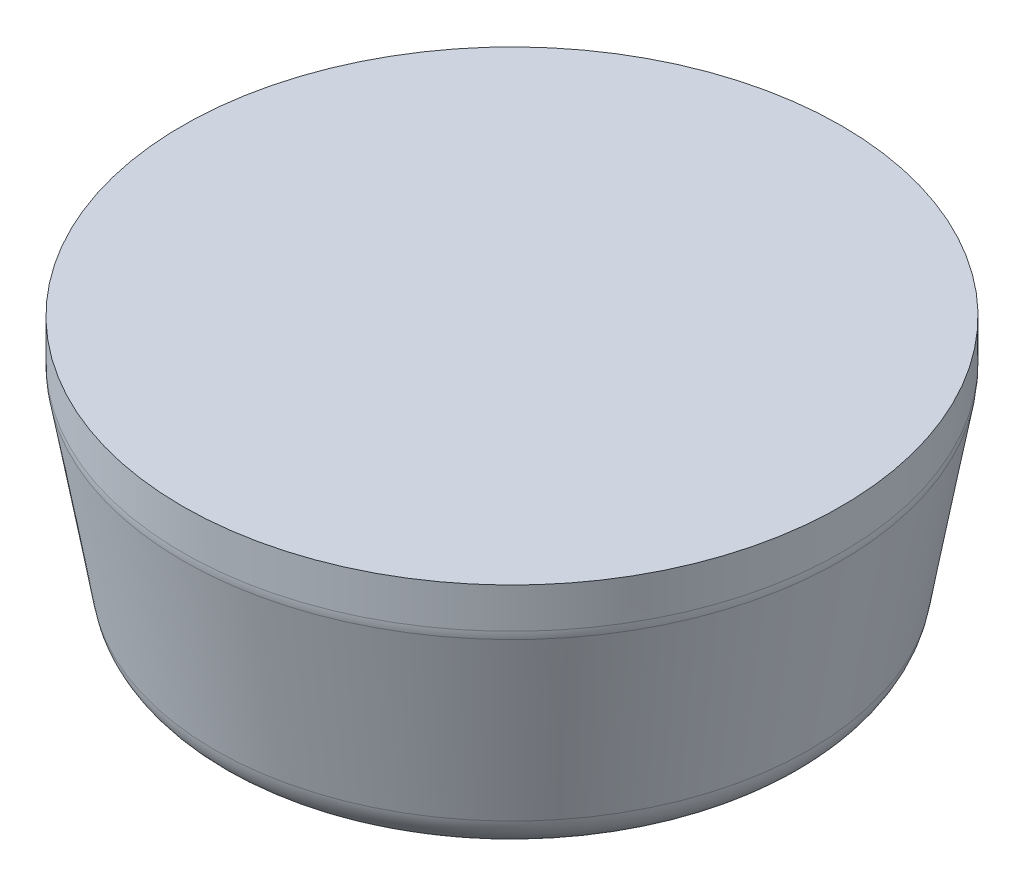
ISO-10303-21;
HEADER;
FILE_DESCRIPTION(('STEP AP214'),'2;1');
FILE_NAME('part.step','',(''),(''),'','','');
FILE_SCHEMA(('AUTOMOTIVE_DESIGN { 1 0 10303 214 1 1 1 1 }'));
ENDSEC;
DATA;
#1=APPLICATION_CONTEXT('core data for automotive mechanical design processes');
#2=APPLICATION_PROTOCOL_DEFINITION('international standard','automotive_design',2000,#1);
#3=PRODUCT_CONTEXT('',#1,'mechanical');
#4=PRODUCT('Part','Part','',(#3));
#5=PRODUCT_RELATED_PRODUCT_CATEGORY('part','',(#4));
#6=PRODUCT_DEFINITION_FORMATION('','',#4);
#7=PRODUCT_DEFINITION_CONTEXT('part definition',#1,'design');
#8=PRODUCT_DEFINITION('design','',#6,#7);
#9=PRODUCT_DEFINITION_SHAPE('','',#8);
#10=(LENGTH_UNIT() NAMED_UNIT(*) SI_UNIT(.MILLI.,.METRE.));
#11=(NAMED_UNIT(*) PLANE_ANGLE_UNIT() SI_UNIT($,.RADIAN.));
#12=(NAMED_UNIT(*) SI_UNIT($,.STERADIAN.) SOLID_ANGLE_UNIT());
#13=UNCERTAINTY_MEASURE_WITH_UNIT(LENGTH_MEASURE(1.E-05),#10,'distance_accuracy_value','');
#14=(GEOMETRIC_REPRESENTATION_CONTEXT(3) GLOBAL_UNCERTAINTY_ASSIGNED_CONTEXT((#13)) GLOBAL_UNIT_ASSIGNED_CONTEXT((#10,
#11,#12)) REPRESENTATION_CONTEXT('',''));
#15=CARTESIAN_POINT('',(0.,0.,0.));
#16=DIRECTION('',(0.,0.,1.));
#17=DIRECTION('',(1.,0.,0.));
#18=AXIS2_PLACEMENT_3D('',#15,#16,#17);
#19=CARTESIAN_POINT('',(0.,0.,0.));
#20=DIRECTION('',(0.,1.,0.));
#21=DIRECTION('',(0.,0.,1.));
#22=AXIS2_PLACEMENT_3D('',#19,#20,#21);
#23=CONICAL_SURFACE('',#22,7.5,0.174532925199433);
#24=CARTESIAN_POINT('',(0.,-0.0861595141410079,0.));
#25=DIRECTION('',(0.,1.,0.));
#26=DIRECTION('',(0.,0.,1.));
#27=AXIS2_PLACEMENT_3D('',#24,#25,#26);
#28=CIRCLE('',#27,7.48480775301221);
#29=CARTESIAN_POINT('',(0.,-0.0861595141410079,7.48480775301221));
#30=VERTEX_POINT('',#29);
#31=EDGE_CURVE('E38',#30,#30,#28,.F.);
#32=ORIENTED_EDGE('',*,*,#31,.T.);
#33=EDGE_LOOP('',(#32));
#34=FACE_BOUND('',#33,.T.);
#35=CARTESIAN_POINT('',(0.,-4.17364817766693,0.));
#36=DIRECTION('',(0.,1.,0.));
#37=DIRECTION('',(0.,0.,1.));
#38=AXIS2_PLACEMENT_3D('',#35,#36,#37);
#39=CIRCLE('',#38,6.7640732182926);
#40=CARTESIAN_POINT('',(0.,-4.17364817766693,6.7640732182926));
#41=VERTEX_POINT('',#40);
#42=EDGE_CURVE('E42',#41,#41,#39,.T.);
#43=ORIENTED_EDGE('',*,*,#42,.T.);
#44=EDGE_LOOP('',(#43));
#45=FACE_BOUND('',#44,.T.);
#46=ADVANCED_FACE('F31',(#34,#45),#23,.T.);
#47=CARTESIAN_POINT('',(0.,-5.,0.));
#48=DIRECTION('',(0.,1.,0.));
#49=DIRECTION('',(0.,0.,1.));
#50=AXIS2_PLACEMENT_3D('',#47,#48,#49);
#51=PLANE('',#50);
#52=CARTESIAN_POINT('',(0.,-5.,0.));
#53=DIRECTION('',(0.,1.,0.));
#54=DIRECTION('',(0.,0.,1.));
#55=AXIS2_PLACEMENT_3D('',#52,#53,#54);
#56=CIRCLE('',#55,5.77926546528039);
#57=CARTESIAN_POINT('',(0.,-5.,5.77926546528039));
#58=VERTEX_POINT('',#57);
#59=EDGE_CURVE('E10',#58,#58,#56,.F.);
#60=ORIENTED_EDGE('',*,*,#59,.T.);
#61=EDGE_LOOP('',(#60));
#62=FACE_BOUND('',#61,.T.);
#63=ADVANCED_FACE('F59',(#62),#51,.F.);
#64=CARTESIAN_POINT('',(0.,1.,0.));
#65=DIRECTION('',(0.,-1.,0.));
#66=DIRECTION('',(0.,0.,-1.));
#67=AXIS2_PLACEMENT_3D('',#64,#65,#66);
#68=CYLINDRICAL_SURFACE('',#67,7.5);
#69=CARTESIAN_POINT('',(0.,0.087488663525923,0.));
#70=DIRECTION('',(0.,-1.,0.));
#71=DIRECTION('',(0.,0.,-1.));
#72=AXIS2_PLACEMENT_3D('',#69,#70,#71);
#73=CIRCLE('',#72,7.5);
#74=CARTESIAN_POINT('',(0.,0.087488663525923,-7.5));
#75=VERTEX_POINT('',#74);
#76=EDGE_CURVE('E46',#75,#75,#73,.F.);
#77=ORIENTED_EDGE('',*,*,#76,.T.);
#78=EDGE_LOOP('',(#77));
#79=FACE_BOUND('',#78,.T.);
#80=CARTESIAN_POINT('',(0.,1.,0.));
#81=DIRECTION('',(0.,1.,0.));
#82=DIRECTION('',(0.,0.,1.));
#83=AXIS2_PLACEMENT_3D('',#80,#81,#82);
#84=CIRCLE('',#83,7.5);
#85=CARTESIAN_POINT('',(0.,1.,7.5));
#86=VERTEX_POINT('',#85);
#87=EDGE_CURVE('E51',#86,#86,#84,.T.);
#88=ORIENTED_EDGE('',*,*,#87,.F.);
#89=EDGE_LOOP('',(#88));
#90=FACE_BOUND('',#89,.T.);
#91=ADVANCED_FACE('F57',(#79,#90),#68,.T.);
#92=CARTESIAN_POINT('',(0.,1.,0.));
#93=DIRECTION('',(0.,1.,0.));
#94=DIRECTION('',(0.,0.,1.));
#95=AXIS2_PLACEMENT_3D('',#92,#93,#94);
#96=PLANE('',#95);
#97=ORIENTED_EDGE('',*,*,#87,.T.);
#98=EDGE_LOOP('',(#97));
#99=FACE_BOUND('',#98,.T.);
#100=ADVANCED_FACE('F55',(#99),#96,.T.);
#101=CARTESIAN_POINT('',(0.,0.087488663525923,0.));
#102=DIRECTION('',(0.,-1.,0.));
#103=DIRECTION('',(0.,0.,-1.));
#104=AXIS2_PLACEMENT_3D('',#101,#102,#103);
#105=TOROIDAL_SURFACE('',#104,6.5,1.);
#106=ORIENTED_EDGE('',*,*,#31,.F.);
#107=EDGE_LOOP('',(#106));
#108=FACE_BOUND('',#107,.T.);
#109=ORIENTED_EDGE('',*,*,#76,.F.);
#110=EDGE_LOOP('',(#109));
#111=FACE_BOUND('',#110,.T.);
#112=ADVANCED_FACE('F67',(#108,#111),#105,.T.);
#113=CARTESIAN_POINT('',(0.,-4.,0.));
#114=DIRECTION('',(0.,1.,0.));
#115=DIRECTION('',(0.,0.,1.));
#116=AXIS2_PLACEMENT_3D('',#113,#114,#115);
#117=TOROIDAL_SURFACE('',#116,5.77926546528039,1.);
#118=ORIENTED_EDGE('',*,*,#59,.F.);
#119=EDGE_LOOP('',(#118));
#120=FACE_BOUND('',#119,.T.);
#121=ORIENTED_EDGE('',*,*,#42,.F.);
#122=EDGE_LOOP('',(#121));
#123=FACE_BOUND('',#122,.T.);
#124=ADVANCED_FACE('F33',(#120,#123),#117,.T.);
#125=CLOSED_SHELL('',(#46,#63,#91,#100,#112,#124));
#126=MANIFOLD_SOLID_BREP('B2',#125);
#127=ADVANCED_BREP_SHAPE_REPRESENTATION('',(#18,#126),#14);
#128=SHAPE_DEFINITION_REPRESENTATION(#9,#127);
ENDSEC;
END-ISO-10303-21;
